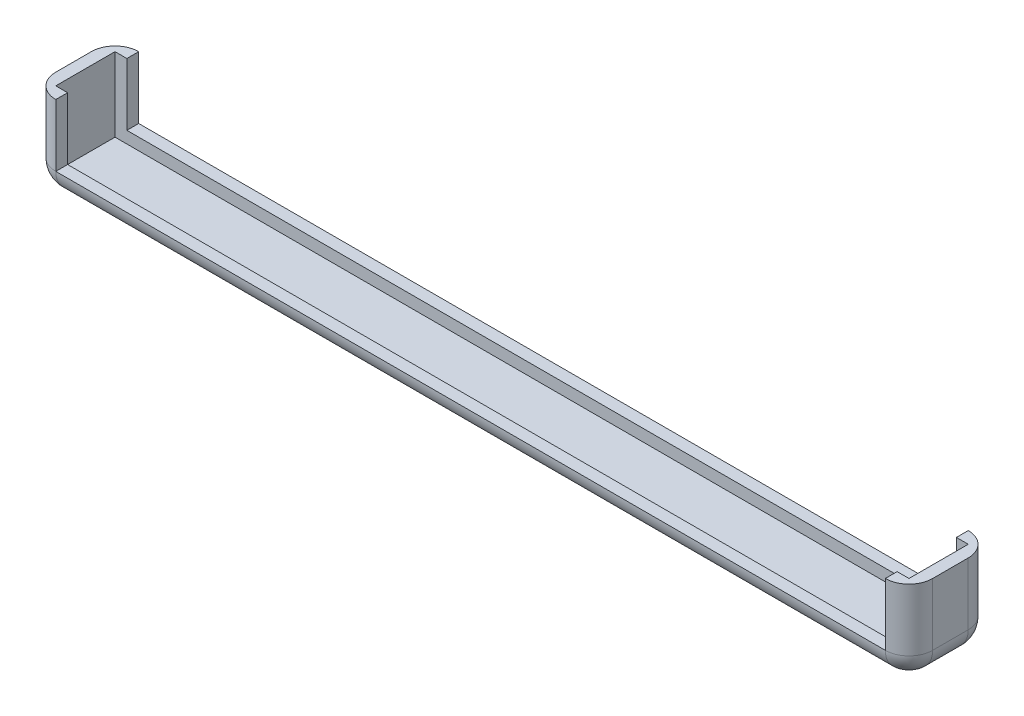
ISO-10303-21;
HEADER;
FILE_DESCRIPTION(('STEP AP214'),'2;1');
FILE_NAME('part.step','',(''),(''),'','','');
FILE_SCHEMA(('AUTOMOTIVE_DESIGN { 1 0 10303 214 1 1 1 1 }'));
ENDSEC;
DATA;
#1=APPLICATION_CONTEXT('core data for automotive mechanical design processes');
#2=APPLICATION_PROTOCOL_DEFINITION('international standard','automotive_design',2000,#1);
#3=PRODUCT_CONTEXT('',#1,'mechanical');
#4=PRODUCT('Part','Part','',(#3));
#5=PRODUCT_RELATED_PRODUCT_CATEGORY('part','',(#4));
#6=PRODUCT_DEFINITION_FORMATION('','',#4);
#7=PRODUCT_DEFINITION_CONTEXT('part definition',#1,'design');
#8=PRODUCT_DEFINITION('design','',#6,#7);
#9=PRODUCT_DEFINITION_SHAPE('','',#8);
#10=(LENGTH_UNIT() NAMED_UNIT(*) SI_UNIT(.MILLI.,.METRE.));
#11=(NAMED_UNIT(*) PLANE_ANGLE_UNIT() SI_UNIT($,.RADIAN.));
#12=(NAMED_UNIT(*) SI_UNIT($,.STERADIAN.) SOLID_ANGLE_UNIT());
#13=UNCERTAINTY_MEASURE_WITH_UNIT(LENGTH_MEASURE(1.E-05),#10,'distance_accuracy_value','');
#14=(GEOMETRIC_REPRESENTATION_CONTEXT(3) GLOBAL_UNCERTAINTY_ASSIGNED_CONTEXT((#13)) GLOBAL_UNIT_ASSIGNED_CONTEXT((#10,
#11,#12)) REPRESENTATION_CONTEXT('',''));
#15=CARTESIAN_POINT('',(0.,0.,0.));
#16=DIRECTION('',(0.,0.,1.));
#17=DIRECTION('',(1.,0.,0.));
#18=AXIS2_PLACEMENT_3D('',#15,#16,#17);
#19=CARTESIAN_POINT('',(0.,184.15,0.));
#20=DIRECTION('',(0.,1.,0.));
#21=DIRECTION('',(0.,0.,1.));
#22=AXIS2_PLACEMENT_3D('',#19,#20,#21);
#23=PLANE('',#22);
#24=DIRECTION('',(0.,0.,1.));
#25=VECTOR('',#24,1.);
#26=CARTESIAN_POINT('',(50.8,184.15,-50.2919999999999));
#27=LINE('',#26,#25);
#28=CARTESIAN_POINT('',(50.8,184.15,0.));
#29=VERTEX_POINT('',#28);
#30=CARTESIAN_POINT('',(50.8,184.15,25.4));
#31=VERTEX_POINT('',#30);
#32=EDGE_CURVE('E215',#29,#31,#27,.T.);
#33=ORIENTED_EDGE('',*,*,#32,.F.);
#34=CARTESIAN_POINT('',(50.8,184.15,50.8));
#35=DIRECTION('',(0.,1.,0.));
#36=DIRECTION('',(0.,0.,1.));
#37=AXIS2_PLACEMENT_3D('',#34,#35,#36);
#38=CIRCLE('',#37,50.8);
#39=CARTESIAN_POINT('',(0.,184.15,50.8));
#40=VERTEX_POINT('',#39);
#41=EDGE_CURVE('E295',#29,#40,#38,.T.);
#42=ORIENTED_EDGE('',*,*,#41,.T.);
#43=DIRECTION('',(0.,0.,1.));
#44=VECTOR('',#43,1.);
#45=CARTESIAN_POINT('',(0.,184.15,0.));
#46=LINE('',#45,#44);
#47=CARTESIAN_POINT('',(0.,184.15,127.));
#48=VERTEX_POINT('',#47);
#49=EDGE_CURVE('E270',#40,#48,#46,.T.);
#50=ORIENTED_EDGE('',*,*,#49,.T.);
#51=CARTESIAN_POINT('',(50.8,184.15,127.));
#52=DIRECTION('',(0.,1.,0.));
#53=DIRECTION('',(0.,0.,1.));
#54=AXIS2_PLACEMENT_3D('',#51,#52,#53);
#55=CIRCLE('',#54,50.8);
#56=CARTESIAN_POINT('',(50.8,184.15,177.8));
#57=VERTEX_POINT('',#56);
#58=EDGE_CURVE('E290',#48,#57,#55,.T.);
#59=ORIENTED_EDGE('',*,*,#58,.T.);
#60=CARTESIAN_POINT('',(50.8,184.15,152.4));
#61=VERTEX_POINT('',#60);
#62=EDGE_CURVE('E208',#61,#57,#27,.T.);
#63=ORIENTED_EDGE('',*,*,#62,.F.);
#64=DIRECTION('',(1.,0.,0.));
#65=VECTOR('',#64,1.);
#66=CARTESIAN_POINT('',(25.3999999999999,184.15,152.4));
#67=LINE('',#66,#65);
#68=CARTESIAN_POINT('',(25.3999999999999,184.15,152.4));
#69=VERTEX_POINT('',#68);
#70=EDGE_CURVE('E258',#69,#61,#67,.T.);
#71=ORIENTED_EDGE('',*,*,#70,.F.);
#72=DIRECTION('',(0.,0.,1.));
#73=VECTOR('',#72,1.);
#74=CARTESIAN_POINT('',(25.3999999999999,184.15,25.4));
#75=LINE('',#74,#73);
#76=CARTESIAN_POINT('',(25.3999999999999,184.15,25.4));
#77=VERTEX_POINT('',#76);
#78=EDGE_CURVE('E241',#77,#69,#75,.T.);
#79=ORIENTED_EDGE('',*,*,#78,.F.);
#80=DIRECTION('',(-1.,0.,0.));
#81=VECTOR('',#80,1.);
#82=CARTESIAN_POINT('',(25.3999999999999,184.15,25.4));
#83=LINE('',#82,#81);
#84=EDGE_CURVE('E264',#31,#77,#83,.T.);
#85=ORIENTED_EDGE('',*,*,#84,.F.);
#86=EDGE_LOOP('',(#33,#42,#50,#59,#63,#71,#79,#85));
#87=FACE_BOUND('',#86,.T.);
#88=ADVANCED_FACE('F37',(#87),#23,.T.);
#89=CARTESIAN_POINT('',(0.,184.15,0.));
#90=DIRECTION('',(1.,0.,0.));
#91=DIRECTION('',(0.,0.,-1.));
#92=AXIS2_PLACEMENT_3D('',#89,#90,#91);
#93=PLANE('',#92);
#94=DIRECTION('',(0.,-1.,0.));
#95=VECTOR('',#94,1.);
#96=CARTESIAN_POINT('',(0.,184.15,50.8));
#97=LINE('',#96,#95);
#98=CARTESIAN_POINT('',(0.,50.8,50.8));
#99=VERTEX_POINT('',#98);
#100=EDGE_CURVE('E292',#40,#99,#97,.T.);
#101=ORIENTED_EDGE('',*,*,#100,.T.);
#102=DIRECTION('',(0.,0.,1.));
#103=VECTOR('',#102,1.);
#104=CARTESIAN_POINT('',(0.,50.8,0.));
#105=LINE('',#104,#103);
#106=CARTESIAN_POINT('',(0.,50.8,127.));
#107=VERTEX_POINT('',#106);
#108=EDGE_CURVE('E193',#99,#107,#105,.T.);
#109=ORIENTED_EDGE('',*,*,#108,.T.);
#110=DIRECTION('',(0.,-1.,0.));
#111=VECTOR('',#110,1.);
#112=CARTESIAN_POINT('',(0.,184.15,127.));
#113=LINE('',#112,#111);
#114=EDGE_CURVE('E192',#107,#48,#113,.F.);
#115=ORIENTED_EDGE('',*,*,#114,.T.);
#116=ORIENTED_EDGE('',*,*,#49,.F.);
#117=EDGE_LOOP('',(#101,#109,#115,#116));
#118=FACE_BOUND('',#117,.T.);
#119=ADVANCED_FACE('F356',(#118),#93,.F.);
#120=CARTESIAN_POINT('',(1879.6,184.15,0.));
#121=DIRECTION('',(-1.,0.,0.));
#122=DIRECTION('',(0.,0.,1.));
#123=AXIS2_PLACEMENT_3D('',#120,#121,#122);
#124=PLANE('',#123);
#125=DIRECTION('',(0.,-1.,0.));
#126=VECTOR('',#125,1.);
#127=CARTESIAN_POINT('',(1879.6,184.15,127.));
#128=LINE('',#127,#126);
#129=CARTESIAN_POINT('',(1879.6,184.15,127.));
#130=VERTEX_POINT('',#129);
#131=CARTESIAN_POINT('',(1879.6,50.8,127.));
#132=VERTEX_POINT('',#131);
#133=EDGE_CURVE('E297',#130,#132,#128,.T.);
#134=ORIENTED_EDGE('',*,*,#133,.T.);
#135=DIRECTION('',(0.,0.,-1.));
#136=VECTOR('',#135,1.);
#137=CARTESIAN_POINT('',(1879.6,50.8,0.));
#138=LINE('',#137,#136);
#139=CARTESIAN_POINT('',(1879.6,50.8,50.8000000000001));
#140=VERTEX_POINT('',#139);
#141=EDGE_CURVE('E46',#132,#140,#138,.T.);
#142=ORIENTED_EDGE('',*,*,#141,.T.);
#143=DIRECTION('',(0.,-1.,0.));
#144=VECTOR('',#143,1.);
#145=CARTESIAN_POINT('',(1879.6,184.15,50.8000000000001));
#146=LINE('',#145,#144);
#147=CARTESIAN_POINT('',(1879.6,184.15,50.8000000000001));
#148=VERTEX_POINT('',#147);
#149=EDGE_CURVE('E301',#140,#148,#146,.F.);
#150=ORIENTED_EDGE('',*,*,#149,.T.);
#151=DIRECTION('',(0.,0.,-1.));
#152=VECTOR('',#151,1.);
#153=CARTESIAN_POINT('',(1879.6,184.15,0.));
#154=LINE('',#153,#152);
#155=EDGE_CURVE('E280',#130,#148,#154,.T.);
#156=ORIENTED_EDGE('',*,*,#155,.F.);
#157=EDGE_LOOP('',(#134,#142,#150,#156));
#158=FACE_BOUND('',#157,.T.);
#159=ADVANCED_FACE('F380',(#158),#124,.F.);
#160=ORIENTED_EDGE('',*,*,#155,.T.);
#161=CARTESIAN_POINT('',(1828.8,184.15,50.8));
#162=DIRECTION('',(0.,1.,0.));
#163=DIRECTION('',(0.,0.,1.));
#164=AXIS2_PLACEMENT_3D('',#161,#162,#163);
#165=CIRCLE('',#164,50.8);
#166=CARTESIAN_POINT('',(1828.8,184.15,0.));
#167=VERTEX_POINT('',#166);
#168=EDGE_CURVE('E194',#148,#167,#165,.T.);
#169=ORIENTED_EDGE('',*,*,#168,.T.);
#170=DIRECTION('',(0.,0.,1.));
#171=VECTOR('',#170,1.);
#172=CARTESIAN_POINT('',(1828.8,184.15,-50.2919999999999));
#173=LINE('',#172,#171);
#174=CARTESIAN_POINT('',(1828.8,184.15,25.4));
#175=VERTEX_POINT('',#174);
#176=EDGE_CURVE('E216',#167,#175,#173,.T.);
#177=ORIENTED_EDGE('',*,*,#176,.T.);
#178=CARTESIAN_POINT('',(1854.2,184.15,25.4));
#179=VERTEX_POINT('',#178);
#180=EDGE_CURVE('E246',#179,#175,#83,.T.);
#181=ORIENTED_EDGE('',*,*,#180,.F.);
#182=DIRECTION('',(0.,0.,-1.));
#183=VECTOR('',#182,1.);
#184=CARTESIAN_POINT('',(1854.2,184.15,25.4));
#185=LINE('',#184,#183);
#186=CARTESIAN_POINT('',(1854.2,184.15,152.4));
#187=VERTEX_POINT('',#186);
#188=EDGE_CURVE('E261',#187,#179,#185,.T.);
#189=ORIENTED_EDGE('',*,*,#188,.F.);
#190=CARTESIAN_POINT('',(1828.8,184.15,152.4));
#191=VERTEX_POINT('',#190);
#192=EDGE_CURVE('E257',#191,#187,#67,.T.);
#193=ORIENTED_EDGE('',*,*,#192,.F.);
#194=CARTESIAN_POINT('',(1828.8,184.15,177.8));
#195=VERTEX_POINT('',#194);
#196=EDGE_CURVE('E217',#191,#195,#173,.T.);
#197=ORIENTED_EDGE('',*,*,#196,.T.);
#198=CARTESIAN_POINT('',(1828.8,184.15,127.));
#199=DIRECTION('',(0.,1.,0.));
#200=DIRECTION('',(0.,0.,1.));
#201=AXIS2_PLACEMENT_3D('',#198,#199,#200);
#202=CIRCLE('',#201,50.8);
#203=EDGE_CURVE('E299',#195,#130,#202,.T.);
#204=ORIENTED_EDGE('',*,*,#203,.T.);
#205=EDGE_LOOP('',(#160,#169,#177,#181,#189,#193,#197,#204));
#206=FACE_BOUND('',#205,.T.);
#207=ADVANCED_FACE('F382',(#206),#23,.T.);
#208=CARTESIAN_POINT('',(0.,0.,0.));
#209=DIRECTION('',(0.,1.,0.));
#210=DIRECTION('',(0.,0.,1.));
#211=AXIS2_PLACEMENT_3D('',#208,#209,#210);
#212=PLANE('',#211);
#213=DIRECTION('',(1.,0.,0.));
#214=VECTOR('',#213,1.);
#215=CARTESIAN_POINT('',(0.,0.,127.));
#216=LINE('',#215,#214);
#217=CARTESIAN_POINT('',(1828.8,0.,127.));
#218=VERTEX_POINT('',#217);
#219=CARTESIAN_POINT('',(50.8,0.,127.));
#220=VERTEX_POINT('',#219);
#221=EDGE_CURVE('E305',#218,#220,#216,.F.);
#222=ORIENTED_EDGE('',*,*,#221,.T.);
#223=DIRECTION('',(0.,0.,1.));
#224=VECTOR('',#223,1.);
#225=CARTESIAN_POINT('',(50.8,0.,0.));
#226=LINE('',#225,#224);
#227=CARTESIAN_POINT('',(50.8,0.,50.8));
#228=VERTEX_POINT('',#227);
#229=EDGE_CURVE('E311',#220,#228,#226,.F.);
#230=ORIENTED_EDGE('',*,*,#229,.T.);
#231=DIRECTION('',(-1.,0.,0.));
#232=VECTOR('',#231,1.);
#233=CARTESIAN_POINT('',(0.,0.,50.8));
#234=LINE('',#233,#232);
#235=CARTESIAN_POINT('',(1828.8,0.,50.8));
#236=VERTEX_POINT('',#235);
#237=EDGE_CURVE('E309',#228,#236,#234,.F.);
#238=ORIENTED_EDGE('',*,*,#237,.T.);
#239=DIRECTION('',(0.,0.,-1.));
#240=VECTOR('',#239,1.);
#241=CARTESIAN_POINT('',(1828.8,0.,2.28388736494318E-12));
#242=LINE('',#241,#240);
#243=EDGE_CURVE('E307',#236,#218,#242,.F.);
#244=ORIENTED_EDGE('',*,*,#243,.T.);
#245=EDGE_LOOP('',(#222,#230,#238,#244));
#246=FACE_BOUND('',#245,.T.);
#247=ADVANCED_FACE('F341',(#246),#212,.F.);
#248=CARTESIAN_POINT('',(25.3999999999999,25.4,25.4));
#249=DIRECTION('',(-1.,0.,0.));
#250=DIRECTION('',(0.,0.,1.));
#251=AXIS2_PLACEMENT_3D('',#248,#249,#250);
#252=PLANE('',#251);
#253=ORIENTED_EDGE('',*,*,#78,.T.);
#254=DIRECTION('',(0.,1.,0.));
#255=VECTOR('',#254,1.);
#256=CARTESIAN_POINT('',(25.3999999999999,25.4,152.4));
#257=LINE('',#256,#255);
#258=CARTESIAN_POINT('',(25.3999999999999,25.4,152.4));
#259=VERTEX_POINT('',#258);
#260=EDGE_CURVE('E255',#259,#69,#257,.T.);
#261=ORIENTED_EDGE('',*,*,#260,.F.);
#262=DIRECTION('',(0.,0.,1.));
#263=VECTOR('',#262,1.);
#264=CARTESIAN_POINT('',(25.3999999999999,25.4,25.4));
#265=LINE('',#264,#263);
#266=CARTESIAN_POINT('',(25.3999999999999,25.4,25.4));
#267=VERTEX_POINT('',#266);
#268=EDGE_CURVE('E242',#267,#259,#265,.T.);
#269=ORIENTED_EDGE('',*,*,#268,.F.);
#270=DIRECTION('',(0.,1.,0.));
#271=VECTOR('',#270,1.);
#272=CARTESIAN_POINT('',(25.3999999999999,25.4,25.4));
#273=LINE('',#272,#271);
#274=EDGE_CURVE('E267',#267,#77,#273,.T.);
#275=ORIENTED_EDGE('',*,*,#274,.T.);
#276=EDGE_LOOP('',(#253,#261,#269,#275));
#277=FACE_BOUND('',#276,.T.);
#278=ADVANCED_FACE('F409',(#277),#252,.F.);
#279=CARTESIAN_POINT('',(25.3999999999999,25.4,25.4));
#280=DIRECTION('',(0.,0.,-1.));
#281=DIRECTION('',(-1.,0.,0.));
#282=AXIS2_PLACEMENT_3D('',#279,#280,#281);
#283=PLANE('',#282);
#284=DIRECTION('',(-1.,0.,0.));
#285=VECTOR('',#284,1.);
#286=CARTESIAN_POINT('',(25.3999999999999,50.8,25.4));
#287=LINE('',#286,#285);
#288=CARTESIAN_POINT('',(1828.8,50.8,25.4));
#289=VERTEX_POINT('',#288);
#290=CARTESIAN_POINT('',(50.8,50.8,25.4));
#291=VERTEX_POINT('',#290);
#292=EDGE_CURVE('E223',#289,#291,#287,.T.);
#293=ORIENTED_EDGE('',*,*,#292,.T.);
#294=DIRECTION('',(0.,1.,0.));
#295=VECTOR('',#294,1.);
#296=CARTESIAN_POINT('',(50.8,25.4,25.4));
#297=LINE('',#296,#295);
#298=EDGE_CURVE('E235',#291,#31,#297,.T.);
#299=ORIENTED_EDGE('',*,*,#298,.T.);
#300=ORIENTED_EDGE('',*,*,#84,.T.);
#301=ORIENTED_EDGE('',*,*,#274,.F.);
#302=DIRECTION('',(-1.,0.,0.));
#303=VECTOR('',#302,1.);
#304=CARTESIAN_POINT('',(25.3999999999999,25.4,25.4));
#305=LINE('',#304,#303);
#306=CARTESIAN_POINT('',(1854.2,25.4,25.4));
#307=VERTEX_POINT('',#306);
#308=EDGE_CURVE('E252',#307,#267,#305,.T.);
#309=ORIENTED_EDGE('',*,*,#308,.F.);
#310=DIRECTION('',(0.,1.,0.));
#311=VECTOR('',#310,1.);
#312=CARTESIAN_POINT('',(1854.2,25.4,25.4));
#313=LINE('',#312,#311);
#314=EDGE_CURVE('E271',#307,#179,#313,.T.);
#315=ORIENTED_EDGE('',*,*,#314,.T.);
#316=ORIENTED_EDGE('',*,*,#180,.T.);
#317=DIRECTION('',(0.,-1.,0.));
#318=VECTOR('',#317,1.);
#319=CARTESIAN_POINT('',(1828.8,25.4,25.4));
#320=LINE('',#319,#318);
#321=EDGE_CURVE('E229',#175,#289,#320,.T.);
#322=ORIENTED_EDGE('',*,*,#321,.T.);
#323=EDGE_LOOP('',(#293,#299,#300,#301,#309,#315,#316,#322));
#324=FACE_BOUND('',#323,.T.);
#325=ADVANCED_FACE('F366',(#324),#283,.F.);
#326=CARTESIAN_POINT('',(1854.2,25.4,25.4));
#327=DIRECTION('',(1.,0.,0.));
#328=DIRECTION('',(0.,0.,-1.));
#329=AXIS2_PLACEMENT_3D('',#326,#327,#328);
#330=PLANE('',#329);
#331=ORIENTED_EDGE('',*,*,#188,.T.);
#332=ORIENTED_EDGE('',*,*,#314,.F.);
#333=DIRECTION('',(0.,0.,-1.));
#334=VECTOR('',#333,1.);
#335=CARTESIAN_POINT('',(1854.2,25.4,25.4));
#336=LINE('',#335,#334);
#337=CARTESIAN_POINT('',(1854.2,25.4,152.4));
#338=VERTEX_POINT('',#337);
#339=EDGE_CURVE('E249',#338,#307,#336,.T.);
#340=ORIENTED_EDGE('',*,*,#339,.F.);
#341=DIRECTION('',(0.,1.,0.));
#342=VECTOR('',#341,1.);
#343=CARTESIAN_POINT('',(1854.2,25.4,152.4));
#344=LINE('',#343,#342);
#345=EDGE_CURVE('E273',#338,#187,#344,.T.);
#346=ORIENTED_EDGE('',*,*,#345,.T.);
#347=EDGE_LOOP('',(#331,#332,#340,#346));
#348=FACE_BOUND('',#347,.T.);
#349=ADVANCED_FACE('F564',(#348),#330,.F.);
#350=CARTESIAN_POINT('',(25.3999999999999,25.4,152.4));
#351=DIRECTION('',(0.,0.,1.));
#352=DIRECTION('',(1.,0.,0.));
#353=AXIS2_PLACEMENT_3D('',#350,#351,#352);
#354=PLANE('',#353);
#355=ORIENTED_EDGE('',*,*,#70,.T.);
#356=DIRECTION('',(0.,-1.,0.));
#357=VECTOR('',#356,1.);
#358=CARTESIAN_POINT('',(50.8,25.4,152.4));
#359=LINE('',#358,#357);
#360=CARTESIAN_POINT('',(50.8,50.8,152.4));
#361=VERTEX_POINT('',#360);
#362=EDGE_CURVE('E287',#61,#361,#359,.T.);
#363=ORIENTED_EDGE('',*,*,#362,.T.);
#364=DIRECTION('',(1.,0.,0.));
#365=VECTOR('',#364,1.);
#366=CARTESIAN_POINT('',(25.3999999999999,50.8,152.4));
#367=LINE('',#366,#365);
#368=CARTESIAN_POINT('',(1828.8,50.8,152.4));
#369=VERTEX_POINT('',#368);
#370=EDGE_CURVE('E200',#361,#369,#367,.T.);
#371=ORIENTED_EDGE('',*,*,#370,.T.);
#372=DIRECTION('',(0.,1.,0.));
#373=VECTOR('',#372,1.);
#374=CARTESIAN_POINT('',(1828.8,25.4,152.4));
#375=LINE('',#374,#373);
#376=EDGE_CURVE('E284',#369,#191,#375,.T.);
#377=ORIENTED_EDGE('',*,*,#376,.T.);
#378=ORIENTED_EDGE('',*,*,#192,.T.);
#379=ORIENTED_EDGE('',*,*,#345,.F.);
#380=DIRECTION('',(1.,0.,0.));
#381=VECTOR('',#380,1.);
#382=CARTESIAN_POINT('',(25.3999999999999,25.4,152.4));
#383=LINE('',#382,#381);
#384=EDGE_CURVE('E245',#259,#338,#383,.T.);
#385=ORIENTED_EDGE('',*,*,#384,.F.);
#386=ORIENTED_EDGE('',*,*,#260,.T.);
#387=EDGE_LOOP('',(#355,#363,#371,#377,#378,#379,#385,#386));
#388=FACE_BOUND('',#387,.T.);
#389=ADVANCED_FACE('F554',(#388),#354,.F.);
#390=CARTESIAN_POINT('',(0.,25.4,0.));
#391=DIRECTION('',(0.,1.,0.));
#392=DIRECTION('',(0.,0.,1.));
#393=AXIS2_PLACEMENT_3D('',#390,#391,#392);
#394=PLANE('',#393);
#395=ORIENTED_EDGE('',*,*,#268,.T.);
#396=ORIENTED_EDGE('',*,*,#384,.T.);
#397=ORIENTED_EDGE('',*,*,#339,.T.);
#398=ORIENTED_EDGE('',*,*,#308,.T.);
#399=EDGE_LOOP('',(#395,#396,#397,#398));
#400=FACE_BOUND('',#399,.T.);
#401=ADVANCED_FACE('F542',(#400),#394,.T.);
#402=CARTESIAN_POINT('',(50.8,50.8,-50.2919999999999));
#403=DIRECTION('',(0.,-1.,0.));
#404=DIRECTION('',(0.,0.,-1.));
#405=AXIS2_PLACEMENT_3D('',#402,#403,#404);
#406=PLANE('',#405);
#407=DIRECTION('',(0.,0.,1.));
#408=VECTOR('',#407,1.);
#409=CARTESIAN_POINT('',(50.8,50.8,-50.2919999999999));
#410=LINE('',#409,#408);
#411=CARTESIAN_POINT('',(50.8,50.8,177.8));
#412=VERTEX_POINT('',#411);
#413=EDGE_CURVE('E197',#361,#412,#410,.T.);
#414=ORIENTED_EDGE('',*,*,#413,.T.);
#415=DIRECTION('',(1.,0.,0.));
#416=VECTOR('',#415,1.);
#417=CARTESIAN_POINT('',(50.8,50.8,177.8));
#418=LINE('',#417,#416);
#419=CARTESIAN_POINT('',(1828.8,50.8,177.8));
#420=VERTEX_POINT('',#419);
#421=EDGE_CURVE('E177',#412,#420,#418,.T.);
#422=ORIENTED_EDGE('',*,*,#421,.T.);
#423=DIRECTION('',(0.,0.,1.));
#424=VECTOR('',#423,1.);
#425=CARTESIAN_POINT('',(1828.8,50.8,-50.2919999999999));
#426=LINE('',#425,#424);
#427=EDGE_CURVE('E221',#369,#420,#426,.T.);
#428=ORIENTED_EDGE('',*,*,#427,.F.);
#429=ORIENTED_EDGE('',*,*,#370,.F.);
#430=EDGE_LOOP('',(#414,#422,#428,#429));
#431=FACE_BOUND('',#430,.T.);
#432=ADVANCED_FACE('F198',(#431),#406,.F.);
#433=CARTESIAN_POINT('',(1828.8,184.15,-50.2919999999999));
#434=DIRECTION('',(1.,0.,0.));
#435=DIRECTION('',(0.,0.,-1.));
#436=AXIS2_PLACEMENT_3D('',#433,#434,#435);
#437=PLANE('',#436);
#438=ORIENTED_EDGE('',*,*,#427,.T.);
#439=DIRECTION('',(0.,1.,0.));
#440=VECTOR('',#439,1.);
#441=CARTESIAN_POINT('',(1828.8,184.15,177.8));
#442=LINE('',#441,#440);
#443=EDGE_CURVE('E183',#420,#195,#442,.T.);
#444=ORIENTED_EDGE('',*,*,#443,.T.);
#445=ORIENTED_EDGE('',*,*,#196,.F.);
#446=ORIENTED_EDGE('',*,*,#376,.F.);
#447=EDGE_LOOP('',(#438,#444,#445,#446));
#448=FACE_BOUND('',#447,.T.);
#449=ADVANCED_FACE('F515',(#448),#437,.F.);
#450=CARTESIAN_POINT('',(50.8,184.15,-50.2919999999999));
#451=DIRECTION('',(-1.,0.,0.));
#452=DIRECTION('',(0.,-1.,0.));
#453=AXIS2_PLACEMENT_3D('',#450,#451,#452);
#454=PLANE('',#453);
#455=ORIENTED_EDGE('',*,*,#62,.T.);
#456=DIRECTION('',(0.,-1.,0.));
#457=VECTOR('',#456,1.);
#458=CARTESIAN_POINT('',(50.8,184.15,177.8));
#459=LINE('',#458,#457);
#460=EDGE_CURVE('E184',#57,#412,#459,.T.);
#461=ORIENTED_EDGE('',*,*,#460,.T.);
#462=ORIENTED_EDGE('',*,*,#413,.F.);
#463=ORIENTED_EDGE('',*,*,#362,.F.);
#464=EDGE_LOOP('',(#455,#461,#462,#463));
#465=FACE_BOUND('',#464,.T.);
#466=ADVANCED_FACE('F206',(#465),#454,.F.);
#467=ORIENTED_EDGE('',*,*,#32,.T.);
#468=ORIENTED_EDGE('',*,*,#298,.F.);
#469=CARTESIAN_POINT('',(50.8,50.8,0.));
#470=VERTEX_POINT('',#469);
#471=EDGE_CURVE('E203',#470,#291,#410,.T.);
#472=ORIENTED_EDGE('',*,*,#471,.F.);
#473=DIRECTION('',(0.,-1.,0.));
#474=VECTOR('',#473,1.);
#475=CARTESIAN_POINT('',(50.8,184.15,0.));
#476=LINE('',#475,#474);
#477=EDGE_CURVE('E238',#29,#470,#476,.T.);
#478=ORIENTED_EDGE('',*,*,#477,.F.);
#479=EDGE_LOOP('',(#467,#468,#472,#478));
#480=FACE_BOUND('',#479,.T.);
#481=ADVANCED_FACE('F363',(#480),#454,.F.);
#482=CARTESIAN_POINT('',(1828.8,50.8,0.));
#483=VERTEX_POINT('',#482);
#484=EDGE_CURVE('E220',#483,#289,#426,.T.);
#485=ORIENTED_EDGE('',*,*,#484,.T.);
#486=ORIENTED_EDGE('',*,*,#321,.F.);
#487=ORIENTED_EDGE('',*,*,#176,.F.);
#488=DIRECTION('',(0.,1.,0.));
#489=VECTOR('',#488,1.);
#490=CARTESIAN_POINT('',(1828.8,184.15,0.));
#491=LINE('',#490,#489);
#492=EDGE_CURVE('E232',#483,#167,#491,.T.);
#493=ORIENTED_EDGE('',*,*,#492,.F.);
#494=EDGE_LOOP('',(#485,#486,#487,#493));
#495=FACE_BOUND('',#494,.T.);
#496=ADVANCED_FACE('F373',(#495),#437,.F.);
#497=ORIENTED_EDGE('',*,*,#471,.T.);
#498=ORIENTED_EDGE('',*,*,#292,.F.);
#499=ORIENTED_EDGE('',*,*,#484,.F.);
#500=DIRECTION('',(1.,0.,0.));
#501=VECTOR('',#500,1.);
#502=CARTESIAN_POINT('',(0.,50.8,0.));
#503=LINE('',#502,#501);
#504=EDGE_CURVE('E226',#470,#483,#503,.T.);
#505=ORIENTED_EDGE('',*,*,#504,.F.);
#506=EDGE_LOOP('',(#497,#498,#499,#505));
#507=FACE_BOUND('',#506,.T.);
#508=ADVANCED_FACE('F370',(#507),#406,.F.);
#509=CARTESIAN_POINT('',(50.8,184.15,127.));
#510=DIRECTION('',(0.,-1.,0.));
#511=DIRECTION('',(0.,0.,-1.));
#512=AXIS2_PLACEMENT_3D('',#509,#510,#511);
#513=CYLINDRICAL_SURFACE('',#512,50.8);
#514=ORIENTED_EDGE('',*,*,#114,.F.);
#515=CARTESIAN_POINT('',(50.8,50.8,127.));
#516=DIRECTION('',(0.,-1.,0.));
#517=DIRECTION('',(0.,0.,-1.));
#518=AXIS2_PLACEMENT_3D('',#515,#516,#517);
#519=CIRCLE('',#518,50.8);
#520=EDGE_CURVE('E168',#107,#412,#519,.F.);
#521=ORIENTED_EDGE('',*,*,#520,.T.);
#522=ORIENTED_EDGE('',*,*,#460,.F.);
#523=ORIENTED_EDGE('',*,*,#58,.F.);
#524=EDGE_LOOP('',(#514,#521,#522,#523));
#525=FACE_BOUND('',#524,.T.);
#526=ADVANCED_FACE('F189',(#525),#513,.T.);
#527=CARTESIAN_POINT('',(50.8,184.15,50.8));
#528=DIRECTION('',(0.,-1.,0.));
#529=DIRECTION('',(0.,0.,-1.));
#530=AXIS2_PLACEMENT_3D('',#527,#528,#529);
#531=CYLINDRICAL_SURFACE('',#530,50.8);
#532=ORIENTED_EDGE('',*,*,#477,.T.);
#533=CARTESIAN_POINT('',(50.8,50.8,50.8));
#534=DIRECTION('',(0.,-1.,0.));
#535=DIRECTION('',(0.,0.,-1.));
#536=AXIS2_PLACEMENT_3D('',#533,#534,#535);
#537=CIRCLE('',#536,50.8);
#538=EDGE_CURVE('E314',#470,#99,#537,.F.);
#539=ORIENTED_EDGE('',*,*,#538,.T.);
#540=ORIENTED_EDGE('',*,*,#100,.F.);
#541=ORIENTED_EDGE('',*,*,#41,.F.);
#542=EDGE_LOOP('',(#532,#539,#540,#541));
#543=FACE_BOUND('',#542,.T.);
#544=ADVANCED_FACE('F352',(#543),#531,.T.);
#545=CARTESIAN_POINT('',(1828.8,184.15,127.));
#546=DIRECTION('',(0.,-1.,0.));
#547=DIRECTION('',(0.,0.,-1.));
#548=AXIS2_PLACEMENT_3D('',#545,#546,#547);
#549=CYLINDRICAL_SURFACE('',#548,50.8);
#550=ORIENTED_EDGE('',*,*,#443,.F.);
#551=CARTESIAN_POINT('',(1828.8,50.8,127.));
#552=DIRECTION('',(0.,-1.,0.));
#553=DIRECTION('',(0.,0.,-1.));
#554=AXIS2_PLACEMENT_3D('',#551,#552,#553);
#555=CIRCLE('',#554,50.8);
#556=EDGE_CURVE('E11',#420,#132,#555,.F.);
#557=ORIENTED_EDGE('',*,*,#556,.T.);
#558=ORIENTED_EDGE('',*,*,#133,.F.);
#559=ORIENTED_EDGE('',*,*,#203,.F.);
#560=EDGE_LOOP('',(#550,#557,#558,#559));
#561=FACE_BOUND('',#560,.T.);
#562=ADVANCED_FACE('F385',(#561),#549,.T.);
#563=CARTESIAN_POINT('',(1828.8,184.15,50.8));
#564=DIRECTION('',(0.,-1.,0.));
#565=DIRECTION('',(0.,0.,-1.));
#566=AXIS2_PLACEMENT_3D('',#563,#564,#565);
#567=CYLINDRICAL_SURFACE('',#566,50.8);
#568=ORIENTED_EDGE('',*,*,#149,.F.);
#569=CARTESIAN_POINT('',(1828.8,50.8,50.8));
#570=DIRECTION('',(0.,-1.,0.));
#571=DIRECTION('',(0.,0.,-1.));
#572=AXIS2_PLACEMENT_3D('',#569,#570,#571);
#573=CIRCLE('',#572,50.8);
#574=EDGE_CURVE('E316',#140,#483,#573,.F.);
#575=ORIENTED_EDGE('',*,*,#574,.T.);
#576=ORIENTED_EDGE('',*,*,#492,.T.);
#577=ORIENTED_EDGE('',*,*,#168,.F.);
#578=EDGE_LOOP('',(#568,#575,#576,#577));
#579=FACE_BOUND('',#578,.T.);
#580=ADVANCED_FACE('F378',(#579),#567,.T.);
#581=CARTESIAN_POINT('',(1828.8,50.8,50.8));
#582=DIRECTION('',(0.,1.,0.));
#583=DIRECTION('',(0.,0.,1.));
#584=AXIS2_PLACEMENT_3D('',#581,#582,#583);
#585=SPHERICAL_SURFACE('',#584,50.8);
#586=CARTESIAN_POINT('',(1828.8,50.8,50.8));
#587=DIRECTION('',(-1.,0.,0.));
#588=DIRECTION('',(0.,0.,1.));
#589=AXIS2_PLACEMENT_3D('',#586,#587,#588);
#590=CIRCLE('',#589,50.8);
#591=EDGE_CURVE('E211',#483,#236,#590,.T.);
#592=ORIENTED_EDGE('',*,*,#591,.F.);
#593=ORIENTED_EDGE('',*,*,#574,.F.);
#594=CARTESIAN_POINT('',(1828.8,50.8,50.8));
#595=DIRECTION('',(0.,0.,1.));
#596=DIRECTION('',(1.,0.,0.));
#597=AXIS2_PLACEMENT_3D('',#594,#595,#596);
#598=CIRCLE('',#597,50.8);
#599=EDGE_CURVE('E41',#236,#140,#598,.T.);
#600=ORIENTED_EDGE('',*,*,#599,.F.);
#601=EDGE_LOOP('',(#592,#593,#600));
#602=FACE_BOUND('',#601,.T.);
#603=ADVANCED_FACE('F39',(#602),#585,.T.);
#604=CARTESIAN_POINT('',(1828.8,50.8,0.));
#605=DIRECTION('',(0.,0.,-1.));
#606=DIRECTION('',(-1.,0.,0.));
#607=AXIS2_PLACEMENT_3D('',#604,#605,#606);
#608=CYLINDRICAL_SURFACE('',#607,50.8);
#609=ORIENTED_EDGE('',*,*,#599,.T.);
#610=ORIENTED_EDGE('',*,*,#141,.F.);
#611=CARTESIAN_POINT('',(1828.8,50.8,127.));
#612=DIRECTION('',(0.,0.,1.));
#613=DIRECTION('',(1.,0.,0.));
#614=AXIS2_PLACEMENT_3D('',#611,#612,#613);
#615=CIRCLE('',#614,50.8);
#616=EDGE_CURVE('E325',#218,#132,#615,.T.);
#617=ORIENTED_EDGE('',*,*,#616,.F.);
#618=ORIENTED_EDGE('',*,*,#243,.F.);
#619=EDGE_LOOP('',(#609,#610,#617,#618));
#620=FACE_BOUND('',#619,.T.);
#621=ADVANCED_FACE('F339',(#620),#608,.T.);
#622=CARTESIAN_POINT('',(0.,50.8,50.8));
#623=DIRECTION('',(-1.,0.,0.));
#624=DIRECTION('',(0.,0.,1.));
#625=AXIS2_PLACEMENT_3D('',#622,#623,#624);
#626=CYLINDRICAL_SURFACE('',#625,50.8);
#627=ORIENTED_EDGE('',*,*,#591,.T.);
#628=ORIENTED_EDGE('',*,*,#237,.F.);
#629=CARTESIAN_POINT('',(50.8,50.8,50.8));
#630=DIRECTION('',(-1.,0.,0.));
#631=DIRECTION('',(0.,0.,1.));
#632=AXIS2_PLACEMENT_3D('',#629,#630,#631);
#633=CIRCLE('',#632,50.8);
#634=EDGE_CURVE('E322',#470,#228,#633,.T.);
#635=ORIENTED_EDGE('',*,*,#634,.F.);
#636=ORIENTED_EDGE('',*,*,#504,.T.);
#637=EDGE_LOOP('',(#627,#628,#635,#636));
#638=FACE_BOUND('',#637,.T.);
#639=ADVANCED_FACE('F332',(#638),#626,.T.);
#640=CARTESIAN_POINT('',(1828.8,50.8,127.));
#641=DIRECTION('',(0.,1.,0.));
#642=DIRECTION('',(0.,0.,1.));
#643=AXIS2_PLACEMENT_3D('',#640,#641,#642);
#644=SPHERICAL_SURFACE('',#643,50.8);
#645=ORIENTED_EDGE('',*,*,#616,.T.);
#646=ORIENTED_EDGE('',*,*,#556,.F.);
#647=CARTESIAN_POINT('',(1828.8,50.8,127.));
#648=DIRECTION('',(-1.,0.,0.));
#649=DIRECTION('',(0.,0.,1.));
#650=AXIS2_PLACEMENT_3D('',#647,#648,#649);
#651=CIRCLE('',#650,50.8);
#652=EDGE_CURVE('E180',#218,#420,#651,.T.);
#653=ORIENTED_EDGE('',*,*,#652,.F.);
#654=EDGE_LOOP('',(#645,#646,#653));
#655=FACE_BOUND('',#654,.T.);
#656=ADVANCED_FACE('F387',(#655),#644,.T.);
#657=CARTESIAN_POINT('',(50.8,50.8,50.8));
#658=DIRECTION('',(0.,1.,0.));
#659=DIRECTION('',(0.,0.,1.));
#660=AXIS2_PLACEMENT_3D('',#657,#658,#659);
#661=SPHERICAL_SURFACE('',#660,50.8);
#662=ORIENTED_EDGE('',*,*,#538,.F.);
#663=ORIENTED_EDGE('',*,*,#634,.T.);
#664=CARTESIAN_POINT('',(50.8,50.8,50.8));
#665=DIRECTION('',(0.,0.,1.));
#666=DIRECTION('',(1.,0.,0.));
#667=AXIS2_PLACEMENT_3D('',#664,#665,#666);
#668=CIRCLE('',#667,50.8);
#669=EDGE_CURVE('E173',#99,#228,#668,.T.);
#670=ORIENTED_EDGE('',*,*,#669,.F.);
#671=EDGE_LOOP('',(#662,#663,#670));
#672=FACE_BOUND('',#671,.T.);
#673=ADVANCED_FACE('F349',(#672),#661,.T.);
#674=CARTESIAN_POINT('',(0.,50.8,127.));
#675=DIRECTION('',(1.,0.,0.));
#676=DIRECTION('',(0.,0.,-1.));
#677=AXIS2_PLACEMENT_3D('',#674,#675,#676);
#678=CYLINDRICAL_SURFACE('',#677,50.8);
#679=ORIENTED_EDGE('',*,*,#652,.T.);
#680=ORIENTED_EDGE('',*,*,#421,.F.);
#681=CARTESIAN_POINT('',(50.8,50.8,127.));
#682=DIRECTION('',(-1.,0.,0.));
#683=DIRECTION('',(0.,0.,1.));
#684=AXIS2_PLACEMENT_3D('',#681,#682,#683);
#685=CIRCLE('',#684,50.8);
#686=EDGE_CURVE('E164',#220,#412,#685,.T.);
#687=ORIENTED_EDGE('',*,*,#686,.F.);
#688=ORIENTED_EDGE('',*,*,#221,.F.);
#689=EDGE_LOOP('',(#679,#680,#687,#688));
#690=FACE_BOUND('',#689,.T.);
#691=ADVANCED_FACE('F178',(#690),#678,.T.);
#692=CARTESIAN_POINT('',(50.8,50.8,0.));
#693=DIRECTION('',(0.,0.,1.));
#694=DIRECTION('',(1.,0.,0.));
#695=AXIS2_PLACEMENT_3D('',#692,#693,#694);
#696=CYLINDRICAL_SURFACE('',#695,50.8);
#697=ORIENTED_EDGE('',*,*,#669,.T.);
#698=ORIENTED_EDGE('',*,*,#229,.F.);
#699=CARTESIAN_POINT('',(50.8,50.8,127.));
#700=DIRECTION('',(0.,0.,1.));
#701=DIRECTION('',(1.,0.,0.));
#702=AXIS2_PLACEMENT_3D('',#699,#700,#701);
#703=CIRCLE('',#702,50.8);
#704=EDGE_CURVE('E170',#107,#220,#703,.T.);
#705=ORIENTED_EDGE('',*,*,#704,.F.);
#706=ORIENTED_EDGE('',*,*,#108,.F.);
#707=EDGE_LOOP('',(#697,#698,#705,#706));
#708=FACE_BOUND('',#707,.T.);
#709=ADVANCED_FACE('F344',(#708),#696,.T.);
#710=CARTESIAN_POINT('',(50.8,50.8,127.));
#711=DIRECTION('',(0.,1.,0.));
#712=DIRECTION('',(0.,0.,1.));
#713=AXIS2_PLACEMENT_3D('',#710,#711,#712);
#714=SPHERICAL_SURFACE('',#713,50.8);
#715=ORIENTED_EDGE('',*,*,#686,.T.);
#716=ORIENTED_EDGE('',*,*,#520,.F.);
#717=ORIENTED_EDGE('',*,*,#704,.T.);
#718=EDGE_LOOP('',(#715,#716,#717));
#719=FACE_BOUND('',#718,.T.);
#720=ADVANCED_FACE('F166',(#719),#714,.T.);
#721=CLOSED_SHELL('',(#88,#119,#159,#207,#247,#278,#325,#349,#389,#401,#432,#449,#466,#481,#496,
#508,#526,#544,#562,#580,#603,#621,#639,#656,#673,#691,#709,#720));
#722=MANIFOLD_SOLID_BREP('B2',#721);
#723=ADVANCED_BREP_SHAPE_REPRESENTATION('',(#18,#722),#14);
#724=SHAPE_DEFINITION_REPRESENTATION(#9,#723);
ENDSEC;
END-ISO-10303-21;
